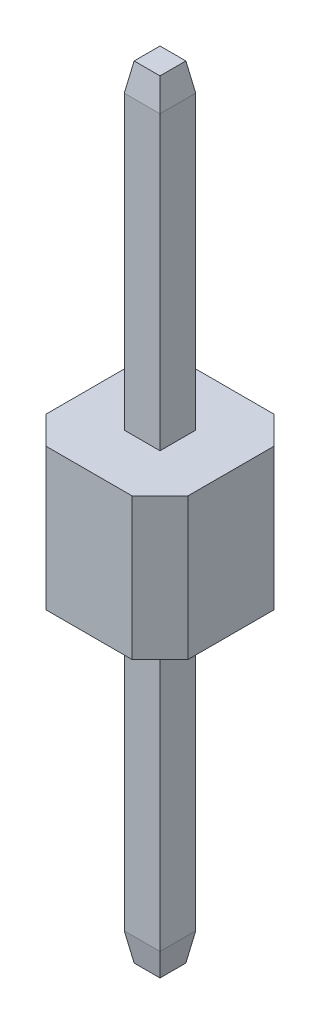
ISO-10303-21;
HEADER;
FILE_DESCRIPTION(('STEP AP214'),'2;1');
FILE_NAME('part.step','',(''),(''),'','','');
FILE_SCHEMA(('AUTOMOTIVE_DESIGN { 1 0 10303 214 1 1 1 1 }'));
ENDSEC;
DATA;
#1=APPLICATION_CONTEXT('core data for automotive mechanical design processes');
#2=APPLICATION_PROTOCOL_DEFINITION('international standard','automotive_design',2000,#1);
#3=PRODUCT_CONTEXT('',#1,'mechanical');
#4=PRODUCT('Part','Part','',(#3));
#5=PRODUCT_RELATED_PRODUCT_CATEGORY('part','',(#4));
#6=PRODUCT_DEFINITION_FORMATION('','',#4);
#7=PRODUCT_DEFINITION_CONTEXT('part definition',#1,'design');
#8=PRODUCT_DEFINITION('design','',#6,#7);
#9=PRODUCT_DEFINITION_SHAPE('','',#8);
#10=(LENGTH_UNIT() NAMED_UNIT(*) SI_UNIT(.MILLI.,.METRE.));
#11=(NAMED_UNIT(*) PLANE_ANGLE_UNIT() SI_UNIT($,.RADIAN.));
#12=(NAMED_UNIT(*) SI_UNIT($,.STERADIAN.) SOLID_ANGLE_UNIT());
#13=UNCERTAINTY_MEASURE_WITH_UNIT(LENGTH_MEASURE(1.E-05),#10,'distance_accuracy_value','');
#14=(GEOMETRIC_REPRESENTATION_CONTEXT(3) GLOBAL_UNCERTAINTY_ASSIGNED_CONTEXT((#13)) GLOBAL_UNIT_ASSIGNED_CONTEXT((#10,
#11,#12)) REPRESENTATION_CONTEXT('',''));
#15=CARTESIAN_POINT('',(0.,0.,0.));
#16=DIRECTION('',(0.,0.,1.));
#17=DIRECTION('',(1.,0.,0.));
#18=AXIS2_PLACEMENT_3D('',#15,#16,#17);
#19=CARTESIAN_POINT('',(-1.27,-1.27,-1.27));
#20=DIRECTION('',(-1.,0.,0.));
#21=DIRECTION('',(0.,0.,1.));
#22=AXIS2_PLACEMENT_3D('',#19,#20,#21);
#23=PLANE('',#22);
#24=DIRECTION('',(0.,0.,1.));
#25=VECTOR('',#24,1.);
#26=CARTESIAN_POINT('',(-1.27,1.27,-1.27));
#27=LINE('',#26,#25);
#28=CARTESIAN_POINT('',(-1.27,1.27,-0.77));
#29=VERTEX_POINT('',#28);
#30=CARTESIAN_POINT('',(-1.27,1.27,0.769999999999998));
#31=VERTEX_POINT('',#30);
#32=EDGE_CURVE('E307',#29,#31,#27,.T.);
#33=ORIENTED_EDGE('',*,*,#32,.F.);
#34=DIRECTION('',(0.,-1.,0.));
#35=VECTOR('',#34,1.);
#36=CARTESIAN_POINT('',(-1.27,-1.27,-0.77));
#37=LINE('',#36,#35);
#38=CARTESIAN_POINT('',(-1.27,-1.27,-0.769999999999999));
#39=VERTEX_POINT('',#38);
#40=EDGE_CURVE('E275',#29,#39,#37,.T.);
#41=ORIENTED_EDGE('',*,*,#40,.T.);
#42=DIRECTION('',(0.,0.,1.));
#43=VECTOR('',#42,1.);
#44=CARTESIAN_POINT('',(-1.27,-1.27,-1.27));
#45=LINE('',#44,#43);
#46=CARTESIAN_POINT('',(-1.27,-1.27,0.769999999999997));
#47=VERTEX_POINT('',#46);
#48=EDGE_CURVE('E305',#39,#47,#45,.T.);
#49=ORIENTED_EDGE('',*,*,#48,.T.);
#50=DIRECTION('',(0.,1.,0.));
#51=VECTOR('',#50,1.);
#52=CARTESIAN_POINT('',(-1.27,-1.27,0.769999999999998));
#53=LINE('',#52,#51);
#54=EDGE_CURVE('E272',#47,#31,#53,.T.);
#55=ORIENTED_EDGE('',*,*,#54,.T.);
#56=EDGE_LOOP('',(#33,#41,#49,#55));
#57=FACE_BOUND('',#56,.T.);
#58=ADVANCED_FACE('F33',(#57),#23,.T.);
#59=CARTESIAN_POINT('',(1.27,-1.27,-1.27));
#60=DIRECTION('',(0.,0.,-1.));
#61=DIRECTION('',(-1.,0.,0.));
#62=AXIS2_PLACEMENT_3D('',#59,#60,#61);
#63=PLANE('',#62);
#64=DIRECTION('',(-1.,0.,0.));
#65=VECTOR('',#64,1.);
#66=CARTESIAN_POINT('',(1.27,-1.27,-1.27));
#67=LINE('',#66,#65);
#68=CARTESIAN_POINT('',(0.769999999999999,-1.27,-1.27));
#69=VERTEX_POINT('',#68);
#70=CARTESIAN_POINT('',(-0.77,-1.27,-1.27));
#71=VERTEX_POINT('',#70);
#72=EDGE_CURVE('E183',#69,#71,#67,.T.);
#73=ORIENTED_EDGE('',*,*,#72,.T.);
#74=DIRECTION('',(0.,1.,0.));
#75=VECTOR('',#74,1.);
#76=CARTESIAN_POINT('',(-0.77,-1.27,-1.27));
#77=LINE('',#76,#75);
#78=CARTESIAN_POINT('',(-0.770000000000001,1.27,-1.27));
#79=VERTEX_POINT('',#78);
#80=EDGE_CURVE('E261',#71,#79,#77,.T.);
#81=ORIENTED_EDGE('',*,*,#80,.T.);
#82=DIRECTION('',(-1.,0.,0.));
#83=VECTOR('',#82,1.);
#84=CARTESIAN_POINT('',(1.27,1.27,-1.27));
#85=LINE('',#84,#83);
#86=CARTESIAN_POINT('',(0.769999999999999,1.27,-1.27));
#87=VERTEX_POINT('',#86);
#88=EDGE_CURVE('E302',#87,#79,#85,.T.);
#89=ORIENTED_EDGE('',*,*,#88,.F.);
#90=DIRECTION('',(0.,-1.,0.));
#91=VECTOR('',#90,1.);
#92=CARTESIAN_POINT('',(0.769999999999999,-1.27,-1.27));
#93=LINE('',#92,#91);
#94=EDGE_CURVE('E239',#87,#69,#93,.T.);
#95=ORIENTED_EDGE('',*,*,#94,.T.);
#96=EDGE_LOOP('',(#73,#81,#89,#95));
#97=FACE_BOUND('',#96,.T.);
#98=ADVANCED_FACE('F319',(#97),#63,.T.);
#99=CARTESIAN_POINT('',(1.27,-1.27,-1.27));
#100=DIRECTION('',(1.,0.,0.));
#101=DIRECTION('',(0.,0.,-1.));
#102=AXIS2_PLACEMENT_3D('',#99,#100,#101);
#103=PLANE('',#102);
#104=DIRECTION('',(0.,0.,-1.));
#105=VECTOR('',#104,1.);
#106=CARTESIAN_POINT('',(1.27,1.27,-1.27));
#107=LINE('',#106,#105);
#108=CARTESIAN_POINT('',(1.27,1.27,0.77));
#109=VERTEX_POINT('',#108);
#110=CARTESIAN_POINT('',(1.27,1.27,-0.77));
#111=VERTEX_POINT('',#110);
#112=EDGE_CURVE('E294',#109,#111,#107,.T.);
#113=ORIENTED_EDGE('',*,*,#112,.F.);
#114=DIRECTION('',(0.,-1.,0.));
#115=VECTOR('',#114,1.);
#116=CARTESIAN_POINT('',(1.27,-1.27,0.77));
#117=LINE('',#116,#115);
#118=CARTESIAN_POINT('',(1.27,-1.27,0.769999999999999));
#119=VERTEX_POINT('',#118);
#120=EDGE_CURVE('E11',#109,#119,#117,.T.);
#121=ORIENTED_EDGE('',*,*,#120,.T.);
#122=DIRECTION('',(0.,0.,-1.));
#123=VECTOR('',#122,1.);
#124=CARTESIAN_POINT('',(1.27,-1.27,-1.27));
#125=LINE('',#124,#123);
#126=CARTESIAN_POINT('',(1.27,-1.27,-0.769999999999999));
#127=VERTEX_POINT('',#126);
#128=EDGE_CURVE('E296',#119,#127,#125,.T.);
#129=ORIENTED_EDGE('',*,*,#128,.T.);
#130=DIRECTION('',(0.,1.,0.));
#131=VECTOR('',#130,1.);
#132=CARTESIAN_POINT('',(1.27,-1.27,-0.77));
#133=LINE('',#132,#131);
#134=EDGE_CURVE('E41',#127,#111,#133,.T.);
#135=ORIENTED_EDGE('',*,*,#134,.T.);
#136=EDGE_LOOP('',(#113,#121,#129,#135));
#137=FACE_BOUND('',#136,.T.);
#138=ADVANCED_FACE('F293',(#137),#103,.T.);
#139=CARTESIAN_POINT('',(1.27,-1.27,1.27));
#140=DIRECTION('',(0.,0.,1.));
#141=DIRECTION('',(1.,0.,0.));
#142=AXIS2_PLACEMENT_3D('',#139,#140,#141);
#143=PLANE('',#142);
#144=DIRECTION('',(1.,0.,0.));
#145=VECTOR('',#144,1.);
#146=CARTESIAN_POINT('',(1.27,1.27,1.27));
#147=LINE('',#146,#145);
#148=CARTESIAN_POINT('',(-0.769999999999997,1.27,1.27));
#149=VERTEX_POINT('',#148);
#150=CARTESIAN_POINT('',(0.770000000000001,1.27,1.27));
#151=VERTEX_POINT('',#150);
#152=EDGE_CURVE('E303',#149,#151,#147,.T.);
#153=ORIENTED_EDGE('',*,*,#152,.F.);
#154=DIRECTION('',(0.,-1.,0.));
#155=VECTOR('',#154,1.);
#156=CARTESIAN_POINT('',(-0.769999999999997,-1.27,1.27));
#157=LINE('',#156,#155);
#158=CARTESIAN_POINT('',(-0.769999999999996,-1.27,1.27));
#159=VERTEX_POINT('',#158);
#160=EDGE_CURVE('E55',#149,#159,#157,.T.);
#161=ORIENTED_EDGE('',*,*,#160,.T.);
#162=DIRECTION('',(1.,0.,0.));
#163=VECTOR('',#162,1.);
#164=CARTESIAN_POINT('',(1.27,-1.27,1.27));
#165=LINE('',#164,#163);
#166=CARTESIAN_POINT('',(0.770000000000001,-1.27,1.27));
#167=VERTEX_POINT('',#166);
#168=EDGE_CURVE('E313',#159,#167,#165,.T.);
#169=ORIENTED_EDGE('',*,*,#168,.T.);
#170=DIRECTION('',(0.,1.,0.));
#171=VECTOR('',#170,1.);
#172=CARTESIAN_POINT('',(0.770000000000001,-1.27,1.27));
#173=LINE('',#172,#171);
#174=EDGE_CURVE('E284',#167,#151,#173,.T.);
#175=ORIENTED_EDGE('',*,*,#174,.T.);
#176=EDGE_LOOP('',(#153,#161,#169,#175));
#177=FACE_BOUND('',#176,.T.);
#178=ADVANCED_FACE('F398',(#177),#143,.T.);
#179=CARTESIAN_POINT('',(0.,-1.27,0.));
#180=DIRECTION('',(0.,-1.,0.));
#181=DIRECTION('',(0.,0.,-1.));
#182=AXIS2_PLACEMENT_3D('',#179,#180,#181);
#183=PLANE('',#182);
#184=DIRECTION('',(0.,0.,-1.));
#185=VECTOR('',#184,1.);
#186=CARTESIAN_POINT('',(-0.32,-1.27,0.));
#187=LINE('',#186,#185);
#188=CARTESIAN_POINT('',(-0.32,-1.27,0.32));
#189=VERTEX_POINT('',#188);
#190=CARTESIAN_POINT('',(-0.32,-1.27,-0.32));
#191=VERTEX_POINT('',#190);
#192=EDGE_CURVE('E330',#189,#191,#187,.T.);
#193=ORIENTED_EDGE('',*,*,#192,.F.);
#194=DIRECTION('',(-1.,0.,0.));
#195=VECTOR('',#194,1.);
#196=CARTESIAN_POINT('',(0.,-1.27,0.32));
#197=LINE('',#196,#195);
#198=CARTESIAN_POINT('',(0.32,-1.27,0.32));
#199=VERTEX_POINT('',#198);
#200=EDGE_CURVE('E340',#199,#189,#197,.T.);
#201=ORIENTED_EDGE('',*,*,#200,.F.);
#202=DIRECTION('',(0.,0.,1.));
#203=VECTOR('',#202,1.);
#204=CARTESIAN_POINT('',(0.32,-1.27,0.));
#205=LINE('',#204,#203);
#206=CARTESIAN_POINT('',(0.32,-1.27,-0.32));
#207=VERTEX_POINT('',#206);
#208=EDGE_CURVE('E337',#207,#199,#205,.T.);
#209=ORIENTED_EDGE('',*,*,#208,.F.);
#210=DIRECTION('',(1.,0.,0.));
#211=VECTOR('',#210,1.);
#212=CARTESIAN_POINT('',(0.,-1.27,-0.32));
#213=LINE('',#212,#211);
#214=EDGE_CURVE('E332',#191,#207,#213,.T.);
#215=ORIENTED_EDGE('',*,*,#214,.F.);
#216=EDGE_LOOP('',(#193,#201,#209,#215));
#217=FACE_BOUND('',#216,.T.);
#218=ORIENTED_EDGE('',*,*,#48,.F.);
#219=DIRECTION('',(-0.707106781186547,0.,0.707106781186548));
#220=VECTOR('',#219,1.);
#221=CARTESIAN_POINT('',(-1.02,-1.27,-1.02));
#222=LINE('',#221,#220);
#223=EDGE_CURVE('E282',#39,#71,#222,.F.);
#224=ORIENTED_EDGE('',*,*,#223,.T.);
#225=ORIENTED_EDGE('',*,*,#72,.F.);
#226=DIRECTION('',(-0.707106781186547,0.,-0.707106781186548));
#227=VECTOR('',#226,1.);
#228=CARTESIAN_POINT('',(1.02,-1.27,-1.02));
#229=LINE('',#228,#227);
#230=EDGE_CURVE('E277',#69,#127,#229,.F.);
#231=ORIENTED_EDGE('',*,*,#230,.T.);
#232=ORIENTED_EDGE('',*,*,#128,.F.);
#233=DIRECTION('',(0.707106781186547,0.,-0.707106781186549));
#234=VECTOR('',#233,1.);
#235=CARTESIAN_POINT('',(1.02,-1.27,1.02));
#236=LINE('',#235,#234);
#237=EDGE_CURVE('E48',#119,#167,#236,.F.);
#238=ORIENTED_EDGE('',*,*,#237,.T.);
#239=ORIENTED_EDGE('',*,*,#168,.F.);
#240=DIRECTION('',(0.707106781186548,0.,0.707106781186547));
#241=VECTOR('',#240,1.);
#242=CARTESIAN_POINT('',(-1.02,-1.27,1.02));
#243=LINE('',#242,#241);
#244=EDGE_CURVE('E280',#159,#47,#243,.F.);
#245=ORIENTED_EDGE('',*,*,#244,.T.);
#246=EDGE_LOOP('',(#218,#224,#225,#231,#232,#238,#239,#245));
#247=FACE_BOUND('',#246,.T.);
#248=ADVANCED_FACE('F438',(#217,#247),#183,.T.);
#249=CARTESIAN_POINT('',(0.,1.27,0.));
#250=DIRECTION('',(0.,-1.,0.));
#251=DIRECTION('',(0.,0.,-1.));
#252=AXIS2_PLACEMENT_3D('',#249,#250,#251);
#253=PLANE('',#252);
#254=DIRECTION('',(-1.,0.,0.));
#255=VECTOR('',#254,1.);
#256=CARTESIAN_POINT('',(0.,1.27,0.32));
#257=LINE('',#256,#255);
#258=CARTESIAN_POINT('',(0.32,1.27,0.32));
#259=VERTEX_POINT('',#258);
#260=CARTESIAN_POINT('',(-0.32,1.27,0.32));
#261=VERTEX_POINT('',#260);
#262=EDGE_CURVE('E171',#259,#261,#257,.T.);
#263=ORIENTED_EDGE('',*,*,#262,.T.);
#264=DIRECTION('',(0.,0.,-1.));
#265=VECTOR('',#264,1.);
#266=CARTESIAN_POINT('',(-0.32,1.27,0.));
#267=LINE('',#266,#265);
#268=CARTESIAN_POINT('',(-0.32,1.27,-0.32));
#269=VERTEX_POINT('',#268);
#270=EDGE_CURVE('E199',#261,#269,#267,.T.);
#271=ORIENTED_EDGE('',*,*,#270,.T.);
#272=DIRECTION('',(1.,0.,0.));
#273=VECTOR('',#272,1.);
#274=CARTESIAN_POINT('',(0.,1.27,-0.32));
#275=LINE('',#274,#273);
#276=CARTESIAN_POINT('',(0.32,1.27,-0.32));
#277=VERTEX_POINT('',#276);
#278=EDGE_CURVE('E197',#269,#277,#275,.T.);
#279=ORIENTED_EDGE('',*,*,#278,.T.);
#280=DIRECTION('',(0.,0.,1.));
#281=VECTOR('',#280,1.);
#282=CARTESIAN_POINT('',(0.32,1.27,0.));
#283=LINE('',#282,#281);
#284=EDGE_CURVE('E182',#277,#259,#283,.T.);
#285=ORIENTED_EDGE('',*,*,#284,.T.);
#286=EDGE_LOOP('',(#263,#271,#279,#285));
#287=FACE_BOUND('',#286,.T.);
#288=ORIENTED_EDGE('',*,*,#88,.T.);
#289=DIRECTION('',(0.707106781186547,0.,-0.707106781186548));
#290=VECTOR('',#289,1.);
#291=CARTESIAN_POINT('',(-0.77,1.27,-1.27));
#292=LINE('',#291,#290);
#293=EDGE_CURVE('E270',#79,#29,#292,.F.);
#294=ORIENTED_EDGE('',*,*,#293,.T.);
#295=ORIENTED_EDGE('',*,*,#32,.T.);
#296=DIRECTION('',(-0.707106781186548,0.,-0.707106781186547));
#297=VECTOR('',#296,1.);
#298=CARTESIAN_POINT('',(-1.27,1.27,0.769999999999998));
#299=LINE('',#298,#297);
#300=EDGE_CURVE('E268',#31,#149,#299,.F.);
#301=ORIENTED_EDGE('',*,*,#300,.T.);
#302=ORIENTED_EDGE('',*,*,#152,.T.);
#303=DIRECTION('',(-0.707106781186547,0.,0.707106781186549));
#304=VECTOR('',#303,1.);
#305=CARTESIAN_POINT('',(0.770000000000001,1.27,1.27));
#306=LINE('',#305,#304);
#307=EDGE_CURVE('E266',#151,#109,#306,.F.);
#308=ORIENTED_EDGE('',*,*,#307,.T.);
#309=ORIENTED_EDGE('',*,*,#112,.T.);
#310=DIRECTION('',(0.707106781186547,0.,0.707106781186548));
#311=VECTOR('',#310,1.);
#312=CARTESIAN_POINT('',(1.27,1.27,-0.77));
#313=LINE('',#312,#311);
#314=EDGE_CURVE('E264',#111,#87,#313,.F.);
#315=ORIENTED_EDGE('',*,*,#314,.T.);
#316=EDGE_LOOP('',(#288,#294,#295,#301,#302,#308,#309,#315));
#317=FACE_BOUND('',#316,.T.);
#318=ADVANCED_FACE('F195',(#287,#317),#253,.F.);
#319=CARTESIAN_POINT('',(0.,7.,0.));
#320=DIRECTION('',(0.,-1.,0.));
#321=DIRECTION('',(0.,0.,-1.));
#322=AXIS2_PLACEMENT_3D('',#319,#320,#321);
#323=PLANE('',#322);
#324=DIRECTION('',(0.,0.,-1.));
#325=VECTOR('',#324,1.);
#326=CARTESIAN_POINT('',(0.231836509645767,7.,-0.32));
#327=LINE('',#326,#325);
#328=CARTESIAN_POINT('',(0.231836509645767,7.,0.231836509645768));
#329=VERTEX_POINT('',#328);
#330=CARTESIAN_POINT('',(0.231836509645767,7.,-0.231836509645767));
#331=VERTEX_POINT('',#330);
#332=EDGE_CURVE('E226',#329,#331,#327,.T.);
#333=ORIENTED_EDGE('',*,*,#332,.T.);
#334=DIRECTION('',(-1.,0.,0.));
#335=VECTOR('',#334,1.);
#336=CARTESIAN_POINT('',(-0.32,7.,-0.231836509645767));
#337=LINE('',#336,#335);
#338=CARTESIAN_POINT('',(-0.231836509645768,7.,-0.231836509645767));
#339=VERTEX_POINT('',#338);
#340=EDGE_CURVE('E228',#331,#339,#337,.T.);
#341=ORIENTED_EDGE('',*,*,#340,.T.);
#342=DIRECTION('',(0.,0.,1.));
#343=VECTOR('',#342,1.);
#344=CARTESIAN_POINT('',(-0.231836509645768,7.,0.32));
#345=LINE('',#344,#343);
#346=CARTESIAN_POINT('',(-0.231836509645768,7.,0.231836509645768));
#347=VERTEX_POINT('',#346);
#348=EDGE_CURVE('E222',#339,#347,#345,.T.);
#349=ORIENTED_EDGE('',*,*,#348,.T.);
#350=DIRECTION('',(1.,0.,0.));
#351=VECTOR('',#350,1.);
#352=CARTESIAN_POINT('',(0.32,7.,0.231836509645768));
#353=LINE('',#352,#351);
#354=EDGE_CURVE('E224',#347,#329,#353,.T.);
#355=ORIENTED_EDGE('',*,*,#354,.T.);
#356=EDGE_LOOP('',(#333,#341,#349,#355));
#357=FACE_BOUND('',#356,.T.);
#358=ADVANCED_FACE('F370',(#357),#323,.F.);
#359=CARTESIAN_POINT('',(0.32,-7.,0.32));
#360=DIRECTION('',(0.,0.,1.));
#361=DIRECTION('',(1.,0.,0.));
#362=AXIS2_PLACEMENT_3D('',#359,#360,#361);
#363=PLANE('',#362);
#364=DIRECTION('',(0.,1.,0.));
#365=VECTOR('',#364,1.);
#366=CARTESIAN_POINT('',(0.32,-7.,0.32));
#367=LINE('',#366,#365);
#368=CARTESIAN_POINT('',(0.32,6.49999999999999,0.32));
#369=VERTEX_POINT('',#368);
#370=EDGE_CURVE('E174',#259,#369,#367,.T.);
#371=ORIENTED_EDGE('',*,*,#370,.T.);
#372=DIRECTION('',(-1.,0.,0.));
#373=VECTOR('',#372,1.);
#374=CARTESIAN_POINT('',(-0.32,6.49999999999999,0.32));
#375=LINE('',#374,#373);
#376=CARTESIAN_POINT('',(-0.32,6.49999999999999,0.32));
#377=VERTEX_POINT('',#376);
#378=EDGE_CURVE('E235',#369,#377,#375,.T.);
#379=ORIENTED_EDGE('',*,*,#378,.T.);
#380=DIRECTION('',(0.,1.,0.));
#381=VECTOR('',#380,1.);
#382=CARTESIAN_POINT('',(-0.32,-7.,0.32));
#383=LINE('',#382,#381);
#384=EDGE_CURVE('E177',#261,#377,#383,.T.);
#385=ORIENTED_EDGE('',*,*,#384,.F.);
#386=ORIENTED_EDGE('',*,*,#262,.F.);
#387=EDGE_LOOP('',(#371,#379,#385,#386));
#388=FACE_BOUND('',#387,.T.);
#389=ADVANCED_FACE('F173',(#388),#363,.T.);
#390=CARTESIAN_POINT('',(0.32,-7.,-0.32));
#391=DIRECTION('',(1.,0.,0.));
#392=DIRECTION('',(0.,0.,-1.));
#393=AXIS2_PLACEMENT_3D('',#390,#391,#392);
#394=PLANE('',#393);
#395=DIRECTION('',(0.,1.,0.));
#396=VECTOR('',#395,1.);
#397=CARTESIAN_POINT('',(0.32,-7.,-0.32));
#398=LINE('',#397,#396);
#399=CARTESIAN_POINT('',(0.32,6.49999999999999,-0.32));
#400=VERTEX_POINT('',#399);
#401=EDGE_CURVE('E345',#277,#400,#398,.T.);
#402=ORIENTED_EDGE('',*,*,#401,.T.);
#403=DIRECTION('',(0.,0.,1.));
#404=VECTOR('',#403,1.);
#405=CARTESIAN_POINT('',(0.32,6.49999999999999,0.32));
#406=LINE('',#405,#404);
#407=EDGE_CURVE('E190',#400,#369,#406,.T.);
#408=ORIENTED_EDGE('',*,*,#407,.T.);
#409=ORIENTED_EDGE('',*,*,#370,.F.);
#410=ORIENTED_EDGE('',*,*,#284,.F.);
#411=EDGE_LOOP('',(#402,#408,#409,#410));
#412=FACE_BOUND('',#411,.T.);
#413=ADVANCED_FACE('F187',(#412),#394,.T.);
#414=CARTESIAN_POINT('',(0.32,-7.,-0.32));
#415=DIRECTION('',(0.,0.,-1.));
#416=DIRECTION('',(-1.,0.,0.));
#417=AXIS2_PLACEMENT_3D('',#414,#415,#416);
#418=PLANE('',#417);
#419=DIRECTION('',(0.,1.,0.));
#420=VECTOR('',#419,1.);
#421=CARTESIAN_POINT('',(-0.32,-7.,-0.32));
#422=LINE('',#421,#420);
#423=CARTESIAN_POINT('',(-0.32,6.49999999999999,-0.32));
#424=VERTEX_POINT('',#423);
#425=EDGE_CURVE('E348',#269,#424,#422,.T.);
#426=ORIENTED_EDGE('',*,*,#425,.T.);
#427=DIRECTION('',(1.,0.,0.));
#428=VECTOR('',#427,1.);
#429=CARTESIAN_POINT('',(0.32,6.49999999999999,-0.32));
#430=LINE('',#429,#428);
#431=EDGE_CURVE('E231',#424,#400,#430,.T.);
#432=ORIENTED_EDGE('',*,*,#431,.T.);
#433=ORIENTED_EDGE('',*,*,#401,.F.);
#434=ORIENTED_EDGE('',*,*,#278,.F.);
#435=EDGE_LOOP('',(#426,#432,#433,#434));
#436=FACE_BOUND('',#435,.T.);
#437=ADVANCED_FACE('F356',(#436),#418,.T.);
#438=CARTESIAN_POINT('',(-0.32,-7.,-0.32));
#439=DIRECTION('',(-1.,0.,0.));
#440=DIRECTION('',(0.,0.,1.));
#441=AXIS2_PLACEMENT_3D('',#438,#439,#440);
#442=PLANE('',#441);
#443=ORIENTED_EDGE('',*,*,#384,.T.);
#444=DIRECTION('',(0.,0.,-1.));
#445=VECTOR('',#444,1.);
#446=CARTESIAN_POINT('',(-0.32,6.49999999999999,-0.32));
#447=LINE('',#446,#445);
#448=EDGE_CURVE('E237',#377,#424,#447,.T.);
#449=ORIENTED_EDGE('',*,*,#448,.T.);
#450=ORIENTED_EDGE('',*,*,#425,.F.);
#451=ORIENTED_EDGE('',*,*,#270,.F.);
#452=EDGE_LOOP('',(#443,#449,#450,#451));
#453=FACE_BOUND('',#452,.T.);
#454=ADVANCED_FACE('F377',(#453),#442,.T.);
#455=CARTESIAN_POINT('',(-0.32,-6.49999999999999,-0.32));
#456=VERTEX_POINT('',#455);
#457=EDGE_CURVE('E343',#456,#191,#422,.T.);
#458=ORIENTED_EDGE('',*,*,#457,.F.);
#459=DIRECTION('',(0.,0.,1.));
#460=VECTOR('',#459,1.);
#461=CARTESIAN_POINT('',(-0.32,-6.49999999999999,-0.32));
#462=LINE('',#461,#460);
#463=CARTESIAN_POINT('',(-0.32,-6.49999999999999,0.32));
#464=VERTEX_POINT('',#463);
#465=EDGE_CURVE('E220',#456,#464,#462,.T.);
#466=ORIENTED_EDGE('',*,*,#465,.T.);
#467=EDGE_CURVE('E192',#464,#189,#383,.T.);
#468=ORIENTED_EDGE('',*,*,#467,.T.);
#469=ORIENTED_EDGE('',*,*,#192,.T.);
#470=EDGE_LOOP('',(#458,#466,#468,#469));
#471=FACE_BOUND('',#470,.T.);
#472=ADVANCED_FACE('F379',(#471),#442,.T.);
#473=CARTESIAN_POINT('',(0.32,-6.49999999999999,-0.32));
#474=VERTEX_POINT('',#473);
#475=EDGE_CURVE('E346',#474,#207,#398,.T.);
#476=ORIENTED_EDGE('',*,*,#475,.F.);
#477=DIRECTION('',(-1.,0.,0.));
#478=VECTOR('',#477,1.);
#479=CARTESIAN_POINT('',(0.32,-6.49999999999999,-0.32));
#480=LINE('',#479,#478);
#481=EDGE_CURVE('E218',#474,#456,#480,.T.);
#482=ORIENTED_EDGE('',*,*,#481,.T.);
#483=ORIENTED_EDGE('',*,*,#457,.T.);
#484=ORIENTED_EDGE('',*,*,#214,.T.);
#485=EDGE_LOOP('',(#476,#482,#483,#484));
#486=FACE_BOUND('',#485,.T.);
#487=ADVANCED_FACE('F385',(#486),#418,.T.);
#488=CARTESIAN_POINT('',(0.32,-6.49999999999999,0.32));
#489=VERTEX_POINT('',#488);
#490=EDGE_CURVE('E191',#489,#199,#367,.T.);
#491=ORIENTED_EDGE('',*,*,#490,.F.);
#492=DIRECTION('',(0.,0.,-1.));
#493=VECTOR('',#492,1.);
#494=CARTESIAN_POINT('',(0.32,-6.49999999999999,-0.32));
#495=LINE('',#494,#493);
#496=EDGE_CURVE('E216',#489,#474,#495,.T.);
#497=ORIENTED_EDGE('',*,*,#496,.T.);
#498=ORIENTED_EDGE('',*,*,#475,.T.);
#499=ORIENTED_EDGE('',*,*,#208,.T.);
#500=EDGE_LOOP('',(#491,#497,#498,#499));
#501=FACE_BOUND('',#500,.T.);
#502=ADVANCED_FACE('F538',(#501),#394,.T.);
#503=ORIENTED_EDGE('',*,*,#467,.F.);
#504=DIRECTION('',(1.,0.,0.));
#505=VECTOR('',#504,1.);
#506=CARTESIAN_POINT('',(0.32,-6.49999999999999,0.32));
#507=LINE('',#506,#505);
#508=EDGE_CURVE('E204',#464,#489,#507,.T.);
#509=ORIENTED_EDGE('',*,*,#508,.T.);
#510=ORIENTED_EDGE('',*,*,#490,.T.);
#511=ORIENTED_EDGE('',*,*,#200,.T.);
#512=EDGE_LOOP('',(#503,#509,#510,#511));
#513=FACE_BOUND('',#512,.T.);
#514=ADVANCED_FACE('F530',(#513),#363,.T.);
#515=CARTESIAN_POINT('',(0.,-7.,0.));
#516=DIRECTION('',(0.,-1.,0.));
#517=DIRECTION('',(0.,0.,-1.));
#518=AXIS2_PLACEMENT_3D('',#515,#516,#517);
#519=PLANE('',#518);
#520=DIRECTION('',(0.,0.,1.));
#521=VECTOR('',#520,1.);
#522=CARTESIAN_POINT('',(0.231836509645767,-7.,0.));
#523=LINE('',#522,#521);
#524=CARTESIAN_POINT('',(0.231836509645767,-7.,-0.231836509645767));
#525=VERTEX_POINT('',#524);
#526=CARTESIAN_POINT('',(0.231836509645767,-7.,0.231836509645768));
#527=VERTEX_POINT('',#526);
#528=EDGE_CURVE('E211',#525,#527,#523,.T.);
#529=ORIENTED_EDGE('',*,*,#528,.T.);
#530=DIRECTION('',(-1.,0.,0.));
#531=VECTOR('',#530,1.);
#532=CARTESIAN_POINT('',(0.,-7.,0.231836509645768));
#533=LINE('',#532,#531);
#534=CARTESIAN_POINT('',(-0.231836509645768,-7.,0.231836509645768));
#535=VERTEX_POINT('',#534);
#536=EDGE_CURVE('E213',#527,#535,#533,.T.);
#537=ORIENTED_EDGE('',*,*,#536,.T.);
#538=DIRECTION('',(0.,0.,-1.));
#539=VECTOR('',#538,1.);
#540=CARTESIAN_POINT('',(-0.231836509645768,-7.,0.));
#541=LINE('',#540,#539);
#542=CARTESIAN_POINT('',(-0.231836509645768,-7.,-0.231836509645767));
#543=VERTEX_POINT('',#542);
#544=EDGE_CURVE('E207',#535,#543,#541,.T.);
#545=ORIENTED_EDGE('',*,*,#544,.T.);
#546=DIRECTION('',(1.,0.,0.));
#547=VECTOR('',#546,1.);
#548=CARTESIAN_POINT('',(0.,-7.,-0.231836509645767));
#549=LINE('',#548,#547);
#550=EDGE_CURVE('E209',#543,#525,#549,.T.);
#551=ORIENTED_EDGE('',*,*,#550,.T.);
#552=EDGE_LOOP('',(#529,#537,#545,#551));
#553=FACE_BOUND('',#552,.T.);
#554=ADVANCED_FACE('F415',(#553),#519,.T.);
#555=CARTESIAN_POINT('',(0.32,-6.49999999999999,-0.32));
#556=DIRECTION('',(0.,0.173648177666927,0.984807753012209));
#557=DIRECTION('',(-1.,0.,0.));
#558=AXIS2_PLACEMENT_3D('',#555,#556,#557);
#559=PLANE('',#558);
#560=DIRECTION('',(-0.171087869746032,-0.970287525247815,0.171087869746032));
#561=VECTOR('',#560,1.);
#562=CARTESIAN_POINT('',(0.32,-6.49999999999999,-0.32));
#563=LINE('',#562,#561);
#564=EDGE_CURVE('E245',#525,#474,#563,.F.);
#565=ORIENTED_EDGE('',*,*,#564,.F.);
#566=ORIENTED_EDGE('',*,*,#550,.F.);
#567=DIRECTION('',(0.171087869746032,-0.970287525247815,0.171087869746032));
#568=VECTOR('',#567,1.);
#569=CARTESIAN_POINT('',(-0.32,-6.49999999999999,-0.32));
#570=LINE('',#569,#568);
#571=EDGE_CURVE('E248',#456,#543,#570,.T.);
#572=ORIENTED_EDGE('',*,*,#571,.F.);
#573=ORIENTED_EDGE('',*,*,#481,.F.);
#574=EDGE_LOOP('',(#565,#566,#572,#573));
#575=FACE_BOUND('',#574,.T.);
#576=ADVANCED_FACE('F411',(#575),#559,.F.);
#577=CARTESIAN_POINT('',(-0.32,-6.49999999999999,-0.32));
#578=DIRECTION('',(0.984807753012209,0.173648177666927,0.));
#579=DIRECTION('',(0.,0.,1.));
#580=AXIS2_PLACEMENT_3D('',#577,#578,#579);
#581=PLANE('',#580);
#582=ORIENTED_EDGE('',*,*,#571,.T.);
#583=ORIENTED_EDGE('',*,*,#544,.F.);
#584=DIRECTION('',(-0.171087869746032,0.970287525247815,0.171087869746032));
#585=VECTOR('',#584,1.);
#586=CARTESIAN_POINT('',(-0.301266522128489,-6.6062428324709,0.301266522128489));
#587=LINE('',#586,#585);
#588=EDGE_CURVE('E242',#464,#535,#587,.F.);
#589=ORIENTED_EDGE('',*,*,#588,.F.);
#590=ORIENTED_EDGE('',*,*,#465,.F.);
#591=EDGE_LOOP('',(#582,#583,#589,#590));
#592=FACE_BOUND('',#591,.T.);
#593=ADVANCED_FACE('F407',(#592),#581,.F.);
#594=CARTESIAN_POINT('',(0.32,-6.49999999999999,-0.32));
#595=DIRECTION('',(-0.984807753012209,0.173648177666927,0.));
#596=DIRECTION('',(0.,0.,-1.));
#597=AXIS2_PLACEMENT_3D('',#594,#595,#596);
#598=PLANE('',#597);
#599=ORIENTED_EDGE('',*,*,#564,.T.);
#600=ORIENTED_EDGE('',*,*,#496,.F.);
#601=DIRECTION('',(-0.171087869746032,-0.970287525247815,-0.171087869746032));
#602=VECTOR('',#601,1.);
#603=CARTESIAN_POINT('',(0.301266522128489,-6.6062428324709,0.30126652212849));
#604=LINE('',#603,#602);
#605=EDGE_CURVE('E240',#527,#489,#604,.F.);
#606=ORIENTED_EDGE('',*,*,#605,.F.);
#607=ORIENTED_EDGE('',*,*,#528,.F.);
#608=EDGE_LOOP('',(#599,#600,#606,#607));
#609=FACE_BOUND('',#608,.T.);
#610=ADVANCED_FACE('F403',(#609),#598,.F.);
#611=CARTESIAN_POINT('',(0.32,-6.49999999999999,0.32));
#612=DIRECTION('',(0.,0.173648177666927,-0.984807753012209));
#613=DIRECTION('',(1.,0.,0.));
#614=AXIS2_PLACEMENT_3D('',#611,#612,#613);
#615=PLANE('',#614);
#616=ORIENTED_EDGE('',*,*,#588,.T.);
#617=ORIENTED_EDGE('',*,*,#536,.F.);
#618=ORIENTED_EDGE('',*,*,#605,.T.);
#619=ORIENTED_EDGE('',*,*,#508,.F.);
#620=EDGE_LOOP('',(#616,#617,#618,#619));
#621=FACE_BOUND('',#620,.T.);
#622=ADVANCED_FACE('F400',(#621),#615,.F.);
#623=CARTESIAN_POINT('',(0.,7.,0.231836509645768));
#624=DIRECTION('',(0.,0.173648177666927,0.984807753012209));
#625=DIRECTION('',(-1.,0.,0.));
#626=AXIS2_PLACEMENT_3D('',#623,#624,#625);
#627=PLANE('',#626);
#628=DIRECTION('',(0.171087869746032,0.970287525247815,-0.171087869746032));
#629=VECTOR('',#628,1.);
#630=CARTESIAN_POINT('',(-0.225050409453178,7.03848588664834,0.225050409453178));
#631=LINE('',#630,#629);
#632=EDGE_CURVE('E255',#377,#347,#631,.T.);
#633=ORIENTED_EDGE('',*,*,#632,.F.);
#634=ORIENTED_EDGE('',*,*,#378,.F.);
#635=DIRECTION('',(-0.171087869746032,0.970287525247815,-0.171087869746032));
#636=VECTOR('',#635,1.);
#637=CARTESIAN_POINT('',(0.225050409453178,7.03848588664834,0.225050409453178));
#638=LINE('',#637,#636);
#639=EDGE_CURVE('E243',#329,#369,#638,.F.);
#640=ORIENTED_EDGE('',*,*,#639,.F.);
#641=ORIENTED_EDGE('',*,*,#354,.F.);
#642=EDGE_LOOP('',(#633,#634,#640,#641));
#643=FACE_BOUND('',#642,.T.);
#644=ADVANCED_FACE('F376',(#643),#627,.T.);
#645=CARTESIAN_POINT('',(0.231836509645767,7.,0.));
#646=DIRECTION('',(0.984807753012209,0.173648177666927,0.));
#647=DIRECTION('',(0.,0.,1.));
#648=AXIS2_PLACEMENT_3D('',#645,#646,#647);
#649=PLANE('',#648);
#650=ORIENTED_EDGE('',*,*,#639,.T.);
#651=ORIENTED_EDGE('',*,*,#407,.F.);
#652=DIRECTION('',(-0.171087869746032,0.970287525247815,0.171087869746032));
#653=VECTOR('',#652,1.);
#654=CARTESIAN_POINT('',(0.225050409453178,7.03848588664834,-0.225050409453178));
#655=LINE('',#654,#653);
#656=EDGE_CURVE('E253',#331,#400,#655,.F.);
#657=ORIENTED_EDGE('',*,*,#656,.F.);
#658=ORIENTED_EDGE('',*,*,#332,.F.);
#659=EDGE_LOOP('',(#650,#651,#657,#658));
#660=FACE_BOUND('',#659,.T.);
#661=ADVANCED_FACE('F374',(#660),#649,.T.);
#662=CARTESIAN_POINT('',(-0.231836509645768,7.,0.));
#663=DIRECTION('',(-0.984807753012209,0.173648177666927,0.));
#664=DIRECTION('',(0.,0.,-1.));
#665=AXIS2_PLACEMENT_3D('',#662,#663,#664);
#666=PLANE('',#665);
#667=ORIENTED_EDGE('',*,*,#632,.T.);
#668=ORIENTED_EDGE('',*,*,#348,.F.);
#669=DIRECTION('',(-0.171087869746032,-0.970287525247815,-0.171087869746032));
#670=VECTOR('',#669,1.);
#671=CARTESIAN_POINT('',(-0.225050409453178,7.03848588664834,-0.225050409453178));
#672=LINE('',#671,#670);
#673=EDGE_CURVE('E251',#424,#339,#672,.F.);
#674=ORIENTED_EDGE('',*,*,#673,.F.);
#675=ORIENTED_EDGE('',*,*,#448,.F.);
#676=EDGE_LOOP('',(#667,#668,#674,#675));
#677=FACE_BOUND('',#676,.T.);
#678=ADVANCED_FACE('F366',(#677),#666,.T.);
#679=CARTESIAN_POINT('',(0.,7.,-0.231836509645767));
#680=DIRECTION('',(0.,0.173648177666927,-0.984807753012209));
#681=DIRECTION('',(1.,0.,0.));
#682=AXIS2_PLACEMENT_3D('',#679,#680,#681);
#683=PLANE('',#682);
#684=ORIENTED_EDGE('',*,*,#656,.T.);
#685=ORIENTED_EDGE('',*,*,#431,.F.);
#686=ORIENTED_EDGE('',*,*,#673,.T.);
#687=ORIENTED_EDGE('',*,*,#340,.F.);
#688=EDGE_LOOP('',(#684,#685,#686,#687));
#689=FACE_BOUND('',#688,.T.);
#690=ADVANCED_FACE('F360',(#689),#683,.T.);
#691=CARTESIAN_POINT('',(-0.77,-1.27,-1.27));
#692=DIRECTION('',(0.707106781186548,0.,0.707106781186547));
#693=DIRECTION('',(0.,1.,0.));
#694=AXIS2_PLACEMENT_3D('',#691,#692,#693);
#695=PLANE('',#694);
#696=ORIENTED_EDGE('',*,*,#223,.F.);
#697=ORIENTED_EDGE('',*,*,#40,.F.);
#698=ORIENTED_EDGE('',*,*,#293,.F.);
#699=ORIENTED_EDGE('',*,*,#80,.F.);
#700=EDGE_LOOP('',(#696,#697,#698,#699));
#701=FACE_BOUND('',#700,.T.);
#702=ADVANCED_FACE('F323',(#701),#695,.F.);
#703=CARTESIAN_POINT('',(-1.27,-1.27,0.769999999999998));
#704=DIRECTION('',(0.707106781186547,0.,-0.707106781186548));
#705=DIRECTION('',(0.,1.,0.));
#706=AXIS2_PLACEMENT_3D('',#703,#704,#705);
#707=PLANE('',#706);
#708=ORIENTED_EDGE('',*,*,#244,.F.);
#709=ORIENTED_EDGE('',*,*,#160,.F.);
#710=ORIENTED_EDGE('',*,*,#300,.F.);
#711=ORIENTED_EDGE('',*,*,#54,.F.);
#712=EDGE_LOOP('',(#708,#709,#710,#711));
#713=FACE_BOUND('',#712,.T.);
#714=ADVANCED_FACE('F427',(#713),#707,.F.);
#715=CARTESIAN_POINT('',(0.770000000000001,-1.27,1.27));
#716=DIRECTION('',(-0.707106781186549,0.,-0.707106781186547));
#717=DIRECTION('',(0.,1.,0.));
#718=AXIS2_PLACEMENT_3D('',#715,#716,#717);
#719=PLANE('',#718);
#720=ORIENTED_EDGE('',*,*,#237,.F.);
#721=ORIENTED_EDGE('',*,*,#120,.F.);
#722=ORIENTED_EDGE('',*,*,#307,.F.);
#723=ORIENTED_EDGE('',*,*,#174,.F.);
#724=EDGE_LOOP('',(#720,#721,#722,#723));
#725=FACE_BOUND('',#724,.T.);
#726=ADVANCED_FACE('F429',(#725),#719,.F.);
#727=CARTESIAN_POINT('',(1.27,-1.27,-0.77));
#728=DIRECTION('',(-0.707106781186548,0.,0.707106781186547));
#729=DIRECTION('',(0.,1.,0.));
#730=AXIS2_PLACEMENT_3D('',#727,#728,#729);
#731=PLANE('',#730);
#732=ORIENTED_EDGE('',*,*,#230,.F.);
#733=ORIENTED_EDGE('',*,*,#94,.F.);
#734=ORIENTED_EDGE('',*,*,#314,.F.);
#735=ORIENTED_EDGE('',*,*,#134,.F.);
#736=EDGE_LOOP('',(#732,#733,#734,#735));
#737=FACE_BOUND('',#736,.T.);
#738=ADVANCED_FACE('F35',(#737),#731,.F.);
#739=CLOSED_SHELL('',(#58,#98,#138,#178,#248,#318,#358,#389,#413,#437,#454,#472,#487,#502,#514,
#554,#576,#593,#610,#622,#644,#661,#678,#690,#702,#714,#726,#738));
#740=MANIFOLD_SOLID_BREP('B2',#739);
#741=ADVANCED_BREP_SHAPE_REPRESENTATION('',(#18,#740),#14);
#742=SHAPE_DEFINITION_REPRESENTATION(#9,#741);
ENDSEC;
END-ISO-10303-21;
